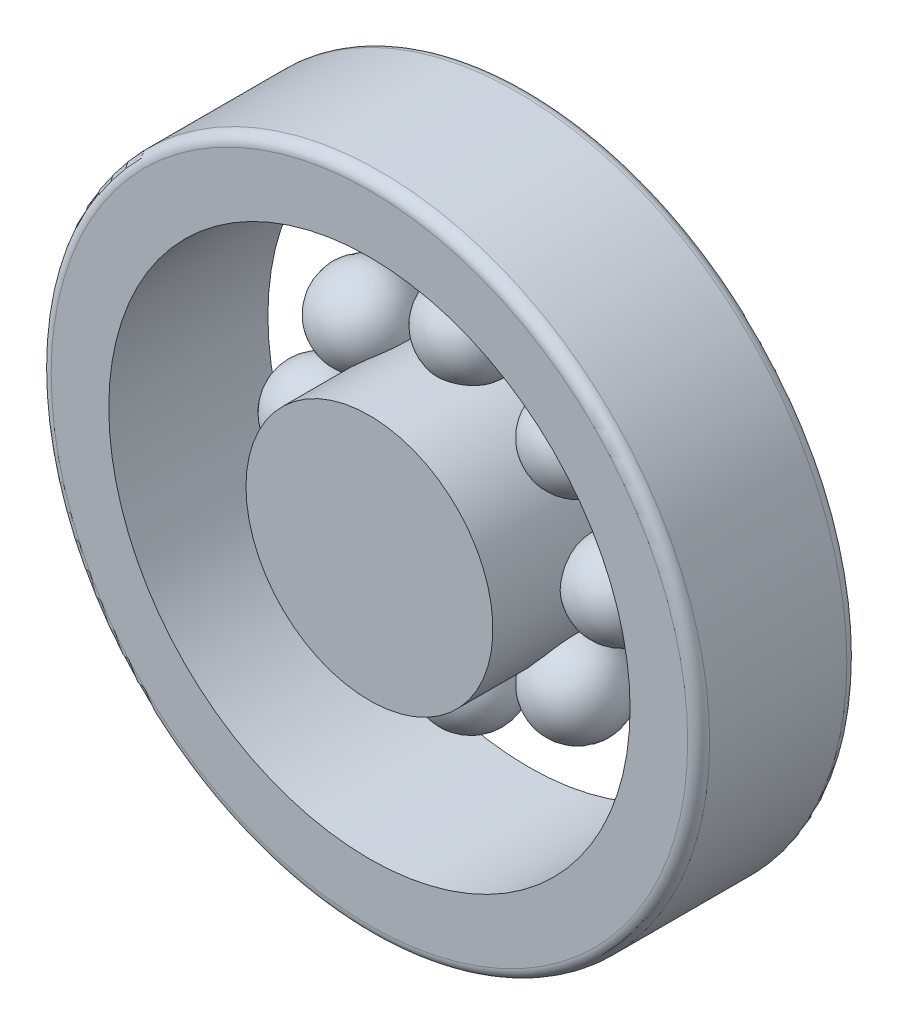
ISO-10303-21;
HEADER;
FILE_DESCRIPTION(('STEP AP214'),'2;1');
FILE_NAME('part.step','',(''),(''),'','','');
FILE_SCHEMA(('AUTOMOTIVE_DESIGN { 1 0 10303 214 1 1 1 1 }'));
ENDSEC;
DATA;
#1=APPLICATION_CONTEXT('core data for automotive mechanical design processes');
#2=APPLICATION_PROTOCOL_DEFINITION('international standard','automotive_design',2000,#1);
#3=PRODUCT_CONTEXT('',#1,'mechanical');
#4=PRODUCT('Part','Part','',(#3));
#5=PRODUCT_RELATED_PRODUCT_CATEGORY('part','',(#4));
#6=PRODUCT_DEFINITION_FORMATION('','',#4);
#7=PRODUCT_DEFINITION_CONTEXT('part definition',#1,'design');
#8=PRODUCT_DEFINITION('design','',#6,#7);
#9=PRODUCT_DEFINITION_SHAPE('','',#8);
#10=(LENGTH_UNIT() NAMED_UNIT(*) SI_UNIT(.MILLI.,.METRE.));
#11=(NAMED_UNIT(*) PLANE_ANGLE_UNIT() SI_UNIT($,.RADIAN.));
#12=(NAMED_UNIT(*) SI_UNIT($,.STERADIAN.) SOLID_ANGLE_UNIT());
#13=UNCERTAINTY_MEASURE_WITH_UNIT(LENGTH_MEASURE(1.E-05),#10,'distance_accuracy_value','');
#14=(GEOMETRIC_REPRESENTATION_CONTEXT(3) GLOBAL_UNCERTAINTY_ASSIGNED_CONTEXT((#13)) GLOBAL_UNIT_ASSIGNED_CONTEXT((#10,
#11,#12)) REPRESENTATION_CONTEXT('',''));
#15=CARTESIAN_POINT('',(0.,0.,0.));
#16=DIRECTION('',(0.,0.,1.));
#17=DIRECTION('',(1.,0.,0.));
#18=AXIS2_PLACEMENT_3D('',#15,#16,#17);
#19=CARTESIAN_POINT('',(19.4454364826303,-19.4454364826298,10.5));
#20=DIRECTION('',(0.,0.,-1.));
#21=DIRECTION('',(0.707106781186556,-0.707106781186539,0.));
#22=AXIS2_PLACEMENT_3D('',#19,#20,#21);
#23=SPHERICAL_SURFACE('',#22,8.);
#24=CARTESIAN_POINT('',(19.4454364826303,-19.4454364826298,2.50000000000001));
#25=VERTEX_POINT('',#24);
#26=VERTEX_LOOP('',#25);
#27=FACE_BOUND('',#26,.T.);
#28=ADVANCED_FACE('F50',(#27),#23,.T.);
#29=CLOSED_SHELL('',(#28));
#30=MANIFOLD_SOLID_BREP('B2',#29);
#31=CARTESIAN_POINT('',(2.88047210454559E-13,-27.5,10.5));
#32=DIRECTION('',(0.,0.,-1.));
#33=DIRECTION('',(0.,-1.,0.));
#34=AXIS2_PLACEMENT_3D('',#31,#32,#33);
#35=SPHERICAL_SURFACE('',#34,8.);
#36=CARTESIAN_POINT('',(2.88047210454559E-13,-27.5,2.50000000000001));
#37=VERTEX_POINT('',#36);
#38=VERTEX_LOOP('',#37);
#39=FACE_BOUND('',#38,.T.);
#40=ADVANCED_FACE('F71',(#39),#35,.T.);
#41=CLOSED_SHELL('',(#40));
#42=MANIFOLD_SOLID_BREP('B7',#41);
#43=CARTESIAN_POINT('',(-19.4454364826299,-19.4454364826302,10.5));
#44=DIRECTION('',(0.,0.,-1.));
#45=DIRECTION('',(-0.707106781186541,-0.707106781186554,0.));
#46=AXIS2_PLACEMENT_3D('',#43,#44,#45);
#47=SPHERICAL_SURFACE('',#46,8.);
#48=CARTESIAN_POINT('',(-19.4454364826299,-19.4454364826302,2.50000000000001));
#49=VERTEX_POINT('',#48);
#50=VERTEX_LOOP('',#49);
#51=FACE_BOUND('',#50,.T.);
#52=ADVANCED_FACE('F92',(#51),#47,.T.);
#53=CLOSED_SHELL('',(#52));
#54=MANIFOLD_SOLID_BREP('B46',#53);
#55=CARTESIAN_POINT('',(-27.5,0.,10.5));
#56=DIRECTION('',(0.,0.,-1.));
#57=DIRECTION('',(-1.,0.,0.));
#58=AXIS2_PLACEMENT_3D('',#55,#56,#57);
#59=SPHERICAL_SURFACE('',#58,8.);
#60=CARTESIAN_POINT('',(-27.5,0.,2.50000000000001));
#61=VERTEX_POINT('',#60);
#62=VERTEX_LOOP('',#61);
#63=FACE_BOUND('',#62,.T.);
#64=ADVANCED_FACE('F113',(#63),#59,.T.);
#65=CLOSED_SHELL('',(#64));
#66=MANIFOLD_SOLID_BREP('B67',#65);
#67=CARTESIAN_POINT('',(-19.4454364826302,19.44543648263,10.5));
#68=DIRECTION('',(0.,0.,-1.));
#69=DIRECTION('',(-0.707106781186551,0.707106781186544,0.));
#70=AXIS2_PLACEMENT_3D('',#67,#68,#69);
#71=SPHERICAL_SURFACE('',#70,8.);
#72=CARTESIAN_POINT('',(-19.4454364826302,19.44543648263,2.50000000000001));
#73=VERTEX_POINT('',#72);
#74=VERTEX_LOOP('',#73);
#75=FACE_BOUND('',#74,.T.);
#76=ADVANCED_FACE('F134',(#75),#71,.T.);
#77=CLOSED_SHELL('',(#76));
#78=MANIFOLD_SOLID_BREP('B88',#77);
#79=CARTESIAN_POINT('',(0.,27.5,10.5));
#80=DIRECTION('',(0.,0.,-1.));
#81=DIRECTION('',(0.,1.,0.));
#82=AXIS2_PLACEMENT_3D('',#79,#80,#81);
#83=SPHERICAL_SURFACE('',#82,8.);
#84=CARTESIAN_POINT('',(0.,27.5,2.50000000000001));
#85=VERTEX_POINT('',#84);
#86=VERTEX_LOOP('',#85);
#87=FACE_BOUND('',#86,.T.);
#88=ADVANCED_FACE('F155',(#87),#83,.T.);
#89=CLOSED_SHELL('',(#88));
#90=MANIFOLD_SOLID_BREP('B109',#89);
#91=CARTESIAN_POINT('',(19.44543648263,19.4454364826301,10.5));
#92=DIRECTION('',(0.,0.,-1.));
#93=DIRECTION('',(0.707106781186546,0.707106781186549,0.));
#94=AXIS2_PLACEMENT_3D('',#91,#92,#93);
#95=SPHERICAL_SURFACE('',#94,8.);
#96=CARTESIAN_POINT('',(19.44543648263,19.4454364826301,2.50000000000001));
#97=VERTEX_POINT('',#96);
#98=VERTEX_LOOP('',#97);
#99=FACE_BOUND('',#98,.T.);
#100=ADVANCED_FACE('F176',(#99),#95,.T.);
#101=CLOSED_SHELL('',(#100));
#102=MANIFOLD_SOLID_BREP('B130',#101);
#103=CARTESIAN_POINT('',(27.5,0.,10.5));
#104=DIRECTION('',(0.,0.,-1.));
#105=DIRECTION('',(1.,0.,0.));
#106=AXIS2_PLACEMENT_3D('',#103,#104,#105);
#107=SPHERICAL_SURFACE('',#106,8.);
#108=CARTESIAN_POINT('',(27.5,0.,2.50000000000001));
#109=VERTEX_POINT('',#108);
#110=VERTEX_LOOP('',#109);
#111=FACE_BOUND('',#110,.T.);
#112=ADVANCED_FACE('F199',(#111),#107,.T.);
#113=CLOSED_SHELL('',(#112));
#114=MANIFOLD_SOLID_BREP('B151',#113);
#115=CARTESIAN_POINT('',(0.,0.,29.));
#116=DIRECTION('',(0.,0.,-1.));
#117=DIRECTION('',(-1.,0.,0.));
#118=AXIS2_PLACEMENT_3D('',#115,#116,#117);
#119=CYLINDRICAL_SURFACE('',#118,22.5);
#120=CARTESIAN_POINT('',(0.,0.,29.));
#121=DIRECTION('',(0.,0.,1.));
#122=DIRECTION('',(1.,0.,0.));
#123=AXIS2_PLACEMENT_3D('',#120,#121,#122);
#124=CIRCLE('',#123,22.5);
#125=CARTESIAN_POINT('',(-22.5,0.,29.));
#126=VERTEX_POINT('',#125);
#127=EDGE_CURVE('E198',#126,#126,#124,.T.);
#128=CARTESIAN_POINT('',(0.,0.,0.));
#129=DIRECTION('',(0.,0.,1.));
#130=DIRECTION('',(1.,0.,0.));
#131=AXIS2_PLACEMENT_3D('',#128,#129,#130);
#132=CIRCLE('',#131,22.5);
#133=CARTESIAN_POINT('',(-22.5,0.,0.));
#134=VERTEX_POINT('',#133);
#135=EDGE_CURVE('E224',#134,#134,#132,.T.);
#136=CARTESIAN_POINT('',(-22.5,0.,29.));
#137=CARTESIAN_POINT('',(-22.5,0.,28.6979166666667));
#138=CARTESIAN_POINT('',(-22.5,0.,28.3958333333333));
#139=CARTESIAN_POINT('',(-22.5,0.,27.7916666666667));
#140=CARTESIAN_POINT('',(-22.5,0.,27.4895833333333));
#141=CARTESIAN_POINT('',(-22.5,0.,26.8854166666667));
#142=CARTESIAN_POINT('',(-22.5,0.,26.5833333333333));
#143=CARTESIAN_POINT('',(-22.5,0.,25.9791666666667));
#144=CARTESIAN_POINT('',(-22.5,0.,25.6770833333333));
#145=CARTESIAN_POINT('',(-22.5,0.,25.0729166666667));
#146=CARTESIAN_POINT('',(-22.5,0.,24.7708333333333));
#147=CARTESIAN_POINT('',(-22.5,0.,24.1666666666667));
#148=CARTESIAN_POINT('',(-22.5,0.,23.8645833333333));
#149=CARTESIAN_POINT('',(-22.5,0.,23.2604166666667));
#150=CARTESIAN_POINT('',(-22.5,0.,22.9583333333333));
#151=CARTESIAN_POINT('',(-22.5,0.,22.3541666666667));
#152=CARTESIAN_POINT('',(-22.5,0.,22.0520833333333));
#153=CARTESIAN_POINT('',(-22.5,0.,21.4479166666667));
#154=CARTESIAN_POINT('',(-22.5,0.,21.1458333333333));
#155=CARTESIAN_POINT('',(-22.5,0.,20.5416666666667));
#156=CARTESIAN_POINT('',(-22.5,0.,20.2395833333333));
#157=CARTESIAN_POINT('',(-22.5,0.,19.6354166666667));
#158=CARTESIAN_POINT('',(-22.5,0.,19.3333333333333));
#159=CARTESIAN_POINT('',(-22.5,0.,18.7291666666667));
#160=CARTESIAN_POINT('',(-22.5,0.,18.4270833333333));
#161=CARTESIAN_POINT('',(-22.5,0.,17.8229166666667));
#162=CARTESIAN_POINT('',(-22.5,0.,17.5208333333333));
#163=CARTESIAN_POINT('',(-22.5,0.,16.9166666666667));
#164=CARTESIAN_POINT('',(-22.5,0.,16.6145833333333));
#165=CARTESIAN_POINT('',(-22.5,0.,16.0104166666667));
#166=CARTESIAN_POINT('',(-22.5,0.,15.7083333333333));
#167=CARTESIAN_POINT('',(-22.5,0.,15.1041666666667));
#168=CARTESIAN_POINT('',(-22.5,0.,14.8020833333333));
#169=CARTESIAN_POINT('',(-22.5,0.,14.1979166666667));
#170=CARTESIAN_POINT('',(-22.5,0.,13.8958333333333));
#171=CARTESIAN_POINT('',(-22.5,0.,13.2916666666667));
#172=CARTESIAN_POINT('',(-22.5,0.,12.9895833333333));
#173=CARTESIAN_POINT('',(-22.5,0.,12.3854166666667));
#174=CARTESIAN_POINT('',(-22.5,0.,12.0833333333333));
#175=CARTESIAN_POINT('',(-22.5,0.,11.4791666666667));
#176=CARTESIAN_POINT('',(-22.5,0.,11.1770833333333));
#177=CARTESIAN_POINT('',(-22.5,0.,10.5729166666667));
#178=CARTESIAN_POINT('',(-22.5,0.,10.2708333333333));
#179=CARTESIAN_POINT('',(-22.5,0.,9.66666666666667));
#180=CARTESIAN_POINT('',(-22.5,0.,9.36458333333333));
#181=CARTESIAN_POINT('',(-22.5,0.,8.76041666666667));
#182=CARTESIAN_POINT('',(-22.5,0.,8.45833333333333));
#183=CARTESIAN_POINT('',(-22.5,0.,7.85416666666667));
#184=CARTESIAN_POINT('',(-22.5,0.,7.55208333333333));
#185=CARTESIAN_POINT('',(-22.5,0.,6.94791666666667));
#186=CARTESIAN_POINT('',(-22.5,0.,6.64583333333333));
#187=CARTESIAN_POINT('',(-22.5,0.,6.04166666666667));
#188=CARTESIAN_POINT('',(-22.5,0.,5.73958333333333));
#189=CARTESIAN_POINT('',(-22.5,0.,5.13541666666667));
#190=CARTESIAN_POINT('',(-22.5,0.,4.83333333333333));
#191=CARTESIAN_POINT('',(-22.5,0.,4.22916666666667));
#192=CARTESIAN_POINT('',(-22.5,0.,3.92708333333333));
#193=CARTESIAN_POINT('',(-22.5,0.,3.32291666666667));
#194=CARTESIAN_POINT('',(-22.5,0.,3.02083333333333));
#195=CARTESIAN_POINT('',(-22.5,0.,2.41666666666667));
#196=CARTESIAN_POINT('',(-22.5,0.,2.11458333333333));
#197=CARTESIAN_POINT('',(-22.5,0.,1.51041666666667));
#198=CARTESIAN_POINT('',(-22.5,0.,1.20833333333333));
#199=CARTESIAN_POINT('',(-22.5,0.,0.604166666666667));
#200=CARTESIAN_POINT('',(-22.5,0.,0.302083333333333));
#201=CARTESIAN_POINT('',(-22.5,0.,0.));
#202=B_SPLINE_CURVE_WITH_KNOTS('',3,(#136,#137,#138,#139,#140,#141,#142,#143,#144,#145,#146,
#147,#148,#149,#150,#151,#152,#153,#154,#155,#156,#157,#158,#159,#160,#161,#162,#163,#164,#165,
#166,#167,#168,#169,#170,#171,#172,#173,#174,#175,#176,#177,#178,#179,#180,#181,#182,#183,#184,
#185,#186,#187,#188,#189,#190,#191,#192,#193,#194,#195,#196,#197,#198,#199,#200,#201),
.UNSPECIFIED.,.F.,.F.,(4,2,2,2,2,2,2,2,2,2,2,2,2,2,2,2,2,2,2,2,2,2,2,2,2,2,2,2,2,2,2,2,4),(0.,
0.906249999999997,1.8125,2.71875,3.625,4.53125,5.4375,6.34375,7.25,8.15625,9.0625,9.96875,
10.875,11.78125,12.6875,13.59375,14.5,15.40625,16.3125,17.21875,18.125,19.03125,19.9375,
20.84375,21.75,22.65625,23.5625,24.46875,25.375,26.28125,27.1875,28.09375,29.),.UNSPECIFIED.);
#203=EDGE_CURVE('BSEAM221',#126,#134,#202,.T.);
#204=ORIENTED_EDGE('',*,*,#127,.F.);
#205=ORIENTED_EDGE('',*,*,#135,.T.);
#206=ORIENTED_EDGE('',*,*,#203,.T.);
#207=ORIENTED_EDGE('',*,*,#203,.F.);
#208=EDGE_LOOP('',(#204,#206,#205,#207));
#209=FACE_BOUND('',#208,.T.);
#210=ADVANCED_FACE('F221',(#209),#119,.T.);
#211=CARTESIAN_POINT('',(0.,0.,29.));
#212=DIRECTION('',(0.,0.,1.));
#213=DIRECTION('',(1.,0.,0.));
#214=AXIS2_PLACEMENT_3D('',#211,#212,#213);
#215=PLANE('',#214);
#216=ORIENTED_EDGE('',*,*,#127,.T.);
#217=EDGE_LOOP('',(#216));
#218=FACE_BOUND('',#217,.T.);
#219=ADVANCED_FACE('F236',(#218),#215,.T.);
#220=CARTESIAN_POINT('',(0.,0.,0.));
#221=DIRECTION('',(0.,0.,1.));
#222=DIRECTION('',(1.,0.,0.));
#223=AXIS2_PLACEMENT_3D('',#220,#221,#222);
#224=PLANE('',#223);
#225=ORIENTED_EDGE('',*,*,#135,.F.);
#226=EDGE_LOOP('',(#225));
#227=FACE_BOUND('',#226,.T.);
#228=ADVANCED_FACE('F234',(#227),#224,.F.);
#229=CLOSED_SHELL('',(#210,#219,#228));
#230=MANIFOLD_SOLID_BREP('B172',#229);
#231=CARTESIAN_POINT('',(0.,0.,29.));
#232=DIRECTION('',(0.,0.,-1.));
#233=DIRECTION('',(-1.,0.,0.));
#234=AXIS2_PLACEMENT_3D('',#231,#232,#233);
#235=CYLINDRICAL_SURFACE('',#234,47.5);
#236=CARTESIAN_POINT('',(0.,0.,29.));
#237=DIRECTION('',(0.,0.,1.));
#238=DIRECTION('',(1.,0.,0.));
#239=AXIS2_PLACEMENT_3D('',#236,#237,#238);
#240=CIRCLE('',#239,47.5);
#241=CARTESIAN_POINT('',(-47.5,0.,29.));
#242=VERTEX_POINT('',#241);
#243=EDGE_CURVE('E288',#242,#242,#240,.T.);
#244=CARTESIAN_POINT('',(0.,0.,0.));
#245=DIRECTION('',(0.,0.,1.));
#246=DIRECTION('',(1.,0.,0.));
#247=AXIS2_PLACEMENT_3D('',#244,#245,#246);
#248=CIRCLE('',#247,47.5);
#249=CARTESIAN_POINT('',(-47.5,0.,0.));
#250=VERTEX_POINT('',#249);
#251=EDGE_CURVE('E289',#250,#250,#248,.T.);
#252=CARTESIAN_POINT('',(-47.5,0.,29.));
#253=CARTESIAN_POINT('',(-47.5,0.,28.6979166666667));
#254=CARTESIAN_POINT('',(-47.5,0.,28.3958333333333));
#255=CARTESIAN_POINT('',(-47.5,0.,27.7916666666667));
#256=CARTESIAN_POINT('',(-47.5,0.,27.4895833333333));
#257=CARTESIAN_POINT('',(-47.5,0.,26.8854166666667));
#258=CARTESIAN_POINT('',(-47.5,0.,26.5833333333333));
#259=CARTESIAN_POINT('',(-47.5,0.,25.9791666666667));
#260=CARTESIAN_POINT('',(-47.5,0.,25.6770833333333));
#261=CARTESIAN_POINT('',(-47.5,0.,25.0729166666667));
#262=CARTESIAN_POINT('',(-47.5,0.,24.7708333333333));
#263=CARTESIAN_POINT('',(-47.5,0.,24.1666666666667));
#264=CARTESIAN_POINT('',(-47.5,0.,23.8645833333333));
#265=CARTESIAN_POINT('',(-47.5,0.,23.2604166666667));
#266=CARTESIAN_POINT('',(-47.5,0.,22.9583333333333));
#267=CARTESIAN_POINT('',(-47.5,0.,22.3541666666667));
#268=CARTESIAN_POINT('',(-47.5,0.,22.0520833333333));
#269=CARTESIAN_POINT('',(-47.5,0.,21.4479166666667));
#270=CARTESIAN_POINT('',(-47.5,0.,21.1458333333333));
#271=CARTESIAN_POINT('',(-47.5,0.,20.5416666666667));
#272=CARTESIAN_POINT('',(-47.5,0.,20.2395833333333));
#273=CARTESIAN_POINT('',(-47.5,0.,19.6354166666667));
#274=CARTESIAN_POINT('',(-47.5,0.,19.3333333333333));
#275=CARTESIAN_POINT('',(-47.5,0.,18.7291666666667));
#276=CARTESIAN_POINT('',(-47.5,0.,18.4270833333333));
#277=CARTESIAN_POINT('',(-47.5,0.,17.8229166666667));
#278=CARTESIAN_POINT('',(-47.5,0.,17.5208333333333));
#279=CARTESIAN_POINT('',(-47.5,0.,16.9166666666667));
#280=CARTESIAN_POINT('',(-47.5,0.,16.6145833333333));
#281=CARTESIAN_POINT('',(-47.5,0.,16.0104166666667));
#282=CARTESIAN_POINT('',(-47.5,0.,15.7083333333333));
#283=CARTESIAN_POINT('',(-47.5,0.,15.1041666666667));
#284=CARTESIAN_POINT('',(-47.5,0.,14.8020833333333));
#285=CARTESIAN_POINT('',(-47.5,0.,14.1979166666667));
#286=CARTESIAN_POINT('',(-47.5,0.,13.8958333333333));
#287=CARTESIAN_POINT('',(-47.5,0.,13.2916666666667));
#288=CARTESIAN_POINT('',(-47.5,0.,12.9895833333333));
#289=CARTESIAN_POINT('',(-47.5,0.,12.3854166666667));
#290=CARTESIAN_POINT('',(-47.5,0.,12.0833333333333));
#291=CARTESIAN_POINT('',(-47.5,0.,11.4791666666667));
#292=CARTESIAN_POINT('',(-47.5,0.,11.1770833333333));
#293=CARTESIAN_POINT('',(-47.5,0.,10.5729166666667));
#294=CARTESIAN_POINT('',(-47.5,0.,10.2708333333333));
#295=CARTESIAN_POINT('',(-47.5,0.,9.66666666666667));
#296=CARTESIAN_POINT('',(-47.5,0.,9.36458333333333));
#297=CARTESIAN_POINT('',(-47.5,0.,8.76041666666667));
#298=CARTESIAN_POINT('',(-47.5,0.,8.45833333333333));
#299=CARTESIAN_POINT('',(-47.5,0.,7.85416666666667));
#300=CARTESIAN_POINT('',(-47.5,0.,7.55208333333333));
#301=CARTESIAN_POINT('',(-47.5,0.,6.94791666666667));
#302=CARTESIAN_POINT('',(-47.5,0.,6.64583333333333));
#303=CARTESIAN_POINT('',(-47.5,0.,6.04166666666667));
#304=CARTESIAN_POINT('',(-47.5,0.,5.73958333333333));
#305=CARTESIAN_POINT('',(-47.5,0.,5.13541666666667));
#306=CARTESIAN_POINT('',(-47.5,0.,4.83333333333333));
#307=CARTESIAN_POINT('',(-47.5,0.,4.22916666666667));
#308=CARTESIAN_POINT('',(-47.5,0.,3.92708333333333));
#309=CARTESIAN_POINT('',(-47.5,0.,3.32291666666667));
#310=CARTESIAN_POINT('',(-47.5,0.,3.02083333333333));
#311=CARTESIAN_POINT('',(-47.5,0.,2.41666666666667));
#312=CARTESIAN_POINT('',(-47.5,0.,2.11458333333333));
#313=CARTESIAN_POINT('',(-47.5,0.,1.51041666666667));
#314=CARTESIAN_POINT('',(-47.5,0.,1.20833333333333));
#315=CARTESIAN_POINT('',(-47.5,0.,0.604166666666667));
#316=CARTESIAN_POINT('',(-47.5,0.,0.302083333333333));
#317=CARTESIAN_POINT('',(-47.5,0.,0.));
#318=B_SPLINE_CURVE_WITH_KNOTS('',3,(#252,#253,#254,#255,#256,#257,#258,#259,#260,#261,#262,
#263,#264,#265,#266,#267,#268,#269,#270,#271,#272,#273,#274,#275,#276,#277,#278,#279,#280,#281,
#282,#283,#284,#285,#286,#287,#288,#289,#290,#291,#292,#293,#294,#295,#296,#297,#298,#299,#300,
#301,#302,#303,#304,#305,#306,#307,#308,#309,#310,#311,#312,#313,#314,#315,#316,#317),
.UNSPECIFIED.,.F.,.F.,(4,2,2,2,2,2,2,2,2,2,2,2,2,2,2,2,2,2,2,2,2,2,2,2,2,2,2,2,2,2,2,2,4),(0.,
0.906249999999997,1.8125,2.71875,3.625,4.53125,5.4375,6.34375,7.25,8.15625,9.0625,9.96875,
10.875,11.78125,12.6875,13.59375,14.5,15.40625,16.3125,17.21875,18.125,19.03125,19.9375,
20.84375,21.75,22.65625,23.5625,24.46875,25.375,26.28125,27.1875,28.09375,29.),.UNSPECIFIED.);
#319=EDGE_CURVE('BSEAM268',#242,#250,#318,.T.);
#320=ORIENTED_EDGE('',*,*,#243,.T.);
#321=ORIENTED_EDGE('',*,*,#251,.F.);
#322=ORIENTED_EDGE('',*,*,#319,.T.);
#323=ORIENTED_EDGE('',*,*,#319,.F.);
#324=EDGE_LOOP('',(#320,#322,#321,#323));
#325=FACE_BOUND('',#324,.T.);
#326=ADVANCED_FACE('F268',(#325),#235,.F.);
#327=CARTESIAN_POINT('',(0.,0.,29.));
#328=DIRECTION('',(0.,0.,-1.));
#329=DIRECTION('',(-1.,0.,0.));
#330=AXIS2_PLACEMENT_3D('',#327,#328,#329);
#331=CYLINDRICAL_SURFACE('',#330,60.);
#332=CARTESIAN_POINT('',(0.,0.,27.));
#333=DIRECTION('',(0.,0.,1.));
#334=DIRECTION('',(1.,0.,0.));
#335=AXIS2_PLACEMENT_3D('',#332,#333,#334);
#336=CIRCLE('',#335,60.);
#337=CARTESIAN_POINT('',(-60.,0.,27.));
#338=VERTEX_POINT('',#337);
#339=EDGE_CURVE('E275',#338,#338,#336,.F.);
#340=CARTESIAN_POINT('',(0.,0.,2.));
#341=DIRECTION('',(0.,0.,1.));
#342=DIRECTION('',(1.,0.,0.));
#343=AXIS2_PLACEMENT_3D('',#340,#341,#342);
#344=CIRCLE('',#343,60.);
#345=CARTESIAN_POINT('',(-60.,0.,1.99999999999999));
#346=VERTEX_POINT('',#345);
#347=EDGE_CURVE('E279',#346,#346,#344,.T.);
#348=CARTESIAN_POINT('',(-60.,0.,27.));
#349=CARTESIAN_POINT('',(-60.,0.,26.7395833333333));
#350=CARTESIAN_POINT('',(-60.,0.,26.4791666666667));
#351=CARTESIAN_POINT('',(-60.,0.,25.9583333333333));
#352=CARTESIAN_POINT('',(-60.,0.,25.6979166666667));
#353=CARTESIAN_POINT('',(-60.,0.,25.1770833333333));
#354=CARTESIAN_POINT('',(-60.,0.,24.9166666666667));
#355=CARTESIAN_POINT('',(-60.,0.,24.3958333333333));
#356=CARTESIAN_POINT('',(-60.,0.,24.1354166666667));
#357=CARTESIAN_POINT('',(-60.,0.,23.6145833333333));
#358=CARTESIAN_POINT('',(-60.,0.,23.3541666666667));
#359=CARTESIAN_POINT('',(-60.,0.,22.8333333333333));
#360=CARTESIAN_POINT('',(-60.,0.,22.5729166666667));
#361=CARTESIAN_POINT('',(-60.,0.,22.0520833333333));
#362=CARTESIAN_POINT('',(-60.,0.,21.7916666666667));
#363=CARTESIAN_POINT('',(-60.,0.,21.2708333333333));
#364=CARTESIAN_POINT('',(-60.,0.,21.0104166666667));
#365=CARTESIAN_POINT('',(-60.,0.,20.4895833333333));
#366=CARTESIAN_POINT('',(-60.,0.,20.2291666666667));
#367=CARTESIAN_POINT('',(-60.,0.,19.7083333333333));
#368=CARTESIAN_POINT('',(-60.,0.,19.4479166666667));
#369=CARTESIAN_POINT('',(-60.,0.,18.9270833333333));
#370=CARTESIAN_POINT('',(-60.,0.,18.6666666666667));
#371=CARTESIAN_POINT('',(-60.,0.,18.1458333333333));
#372=CARTESIAN_POINT('',(-60.,0.,17.8854166666667));
#373=CARTESIAN_POINT('',(-60.,0.,17.3645833333333));
#374=CARTESIAN_POINT('',(-60.,0.,17.1041666666667));
#375=CARTESIAN_POINT('',(-60.,0.,16.5833333333333));
#376=CARTESIAN_POINT('',(-60.,0.,16.3229166666667));
#377=CARTESIAN_POINT('',(-60.,0.,15.8020833333333));
#378=CARTESIAN_POINT('',(-60.,0.,15.5416666666667));
#379=CARTESIAN_POINT('',(-60.,0.,15.0208333333333));
#380=CARTESIAN_POINT('',(-60.,0.,14.7604166666667));
#381=CARTESIAN_POINT('',(-60.,0.,14.2395833333333));
#382=CARTESIAN_POINT('',(-60.,0.,13.9791666666667));
#383=CARTESIAN_POINT('',(-60.,0.,13.4583333333333));
#384=CARTESIAN_POINT('',(-60.,0.,13.1979166666667));
#385=CARTESIAN_POINT('',(-60.,0.,12.6770833333333));
#386=CARTESIAN_POINT('',(-60.,0.,12.4166666666667));
#387=CARTESIAN_POINT('',(-60.,0.,11.8958333333333));
#388=CARTESIAN_POINT('',(-60.,0.,11.6354166666667));
#389=CARTESIAN_POINT('',(-60.,0.,11.1145833333333));
#390=CARTESIAN_POINT('',(-60.,0.,10.8541666666667));
#391=CARTESIAN_POINT('',(-60.,0.,10.3333333333333));
#392=CARTESIAN_POINT('',(-60.,0.,10.0729166666667));
#393=CARTESIAN_POINT('',(-60.,0.,9.55208333333333));
#394=CARTESIAN_POINT('',(-60.,0.,9.29166666666666));
#395=CARTESIAN_POINT('',(-60.,0.,8.77083333333333));
#396=CARTESIAN_POINT('',(-60.,0.,8.51041666666666));
#397=CARTESIAN_POINT('',(-60.,0.,7.98958333333333));
#398=CARTESIAN_POINT('',(-60.,0.,7.72916666666666));
#399=CARTESIAN_POINT('',(-60.,0.,7.20833333333333));
#400=CARTESIAN_POINT('',(-60.,0.,6.94791666666666));
#401=CARTESIAN_POINT('',(-60.,0.,6.42708333333333));
#402=CARTESIAN_POINT('',(-60.,0.,6.16666666666666));
#403=CARTESIAN_POINT('',(-60.,0.,5.64583333333333));
#404=CARTESIAN_POINT('',(-60.,0.,5.38541666666666));
#405=CARTESIAN_POINT('',(-60.,0.,4.86458333333333));
#406=CARTESIAN_POINT('',(-60.,0.,4.60416666666666));
#407=CARTESIAN_POINT('',(-60.,0.,4.08333333333333));
#408=CARTESIAN_POINT('',(-60.,0.,3.82291666666666));
#409=CARTESIAN_POINT('',(-60.,0.,3.30208333333333));
#410=CARTESIAN_POINT('',(-60.,0.,3.04166666666666));
#411=CARTESIAN_POINT('',(-60.,0.,2.52083333333333));
#412=CARTESIAN_POINT('',(-60.,0.,2.26041666666666));
#413=CARTESIAN_POINT('',(-60.,0.,1.99999999999999));
#414=B_SPLINE_CURVE_WITH_KNOTS('',3,(#348,#349,#350,#351,#352,#353,#354,#355,#356,#357,#358,
#359,#360,#361,#362,#363,#364,#365,#366,#367,#368,#369,#370,#371,#372,#373,#374,#375,#376,#377,
#378,#379,#380,#381,#382,#383,#384,#385,#386,#387,#388,#389,#390,#391,#392,#393,#394,#395,#396,
#397,#398,#399,#400,#401,#402,#403,#404,#405,#406,#407,#408,#409,#410,#411,#412,#413),
.UNSPECIFIED.,.F.,.F.,(4,2,2,2,2,2,2,2,2,2,2,2,2,2,2,2,2,2,2,2,2,2,2,2,2,2,2,2,2,2,2,2,4),(0.,
0.781250000000001,1.5625,2.34375,3.125,3.90625,4.6875,5.46875,6.25,7.03125,7.8125,8.59375,9.375,
10.15625,10.9375,11.71875,12.5,13.28125,14.0625,14.84375,15.625,16.40625,17.1875,17.96875,18.75,
19.53125,20.3125,21.09375,21.875,22.65625,23.4375,24.21875,25.),.UNSPECIFIED.);
#415=EDGE_CURVE('BSEAM300',#338,#346,#414,.T.);
#416=ORIENTED_EDGE('',*,*,#339,.T.);
#417=ORIENTED_EDGE('',*,*,#347,.T.);
#418=ORIENTED_EDGE('',*,*,#415,.T.);
#419=ORIENTED_EDGE('',*,*,#415,.F.);
#420=EDGE_LOOP('',(#416,#418,#417,#419));
#421=FACE_BOUND('',#420,.T.);
#422=ADVANCED_FACE('F300',(#421),#331,.T.);
#423=CARTESIAN_POINT('',(0.,0.,29.));
#424=DIRECTION('',(0.,0.,1.));
#425=DIRECTION('',(1.,0.,0.));
#426=AXIS2_PLACEMENT_3D('',#423,#424,#425);
#427=PLANE('',#426);
#428=CARTESIAN_POINT('',(0.,0.,29.));
#429=DIRECTION('',(0.,0.,1.));
#430=DIRECTION('',(1.,0.,0.));
#431=AXIS2_PLACEMENT_3D('',#428,#429,#430);
#432=CIRCLE('',#431,58.);
#433=CARTESIAN_POINT('',(58.,0.,29.));
#434=VERTEX_POINT('',#433);
#435=EDGE_CURVE('E283',#434,#434,#432,.T.);
#436=ORIENTED_EDGE('',*,*,#435,.T.);
#437=EDGE_LOOP('',(#436));
#438=FACE_BOUND('',#437,.T.);
#439=ORIENTED_EDGE('',*,*,#243,.F.);
#440=EDGE_LOOP('',(#439));
#441=FACE_BOUND('',#440,.T.);
#442=ADVANCED_FACE('F297',(#438,#441),#427,.T.);
#443=CARTESIAN_POINT('',(0.,0.,0.));
#444=DIRECTION('',(0.,0.,1.));
#445=DIRECTION('',(1.,0.,0.));
#446=AXIS2_PLACEMENT_3D('',#443,#444,#445);
#447=PLANE('',#446);
#448=CARTESIAN_POINT('',(0.,0.,0.));
#449=DIRECTION('',(0.,0.,1.));
#450=DIRECTION('',(1.,0.,0.));
#451=AXIS2_PLACEMENT_3D('',#448,#449,#450);
#452=CIRCLE('',#451,58.);
#453=CARTESIAN_POINT('',(58.,0.,0.));
#454=VERTEX_POINT('',#453);
#455=EDGE_CURVE('E220',#454,#454,#452,.F.);
#456=ORIENTED_EDGE('',*,*,#455,.T.);
#457=EDGE_LOOP('',(#456));
#458=FACE_BOUND('',#457,.T.);
#459=ORIENTED_EDGE('',*,*,#251,.T.);
#460=EDGE_LOOP('',(#459));
#461=FACE_BOUND('',#460,.T.);
#462=ADVANCED_FACE('F299',(#458,#461),#447,.F.);
#463=CARTESIAN_POINT('',(0.,0.,27.));
#464=DIRECTION('',(0.,0.,1.));
#465=DIRECTION('',(1.,0.,0.));
#466=AXIS2_PLACEMENT_3D('',#463,#464,#465);
#467=TOROIDAL_SURFACE('',#466,58.,2.);
#468=ORIENTED_EDGE('',*,*,#339,.F.);
#469=EDGE_LOOP('',(#468));
#470=FACE_BOUND('',#469,.T.);
#471=ORIENTED_EDGE('',*,*,#435,.F.);
#472=EDGE_LOOP('',(#471));
#473=FACE_BOUND('',#472,.T.);
#474=ADVANCED_FACE('F307',(#470,#473),#467,.T.);
#475=CARTESIAN_POINT('',(0.,0.,2.));
#476=DIRECTION('',(0.,0.,1.));
#477=DIRECTION('',(1.,0.,0.));
#478=AXIS2_PLACEMENT_3D('',#475,#476,#477);
#479=TOROIDAL_SURFACE('',#478,58.,2.);
#480=ORIENTED_EDGE('',*,*,#455,.F.);
#481=EDGE_LOOP('',(#480));
#482=FACE_BOUND('',#481,.T.);
#483=ORIENTED_EDGE('',*,*,#347,.F.);
#484=EDGE_LOOP('',(#483));
#485=FACE_BOUND('',#484,.T.);
#486=ADVANCED_FACE('F270',(#482,#485),#479,.T.);
#487=CLOSED_SHELL('',(#326,#422,#442,#462,#474,#486));
#488=MANIFOLD_SOLID_BREP('B193',#487);
#489=ADVANCED_BREP_SHAPE_REPRESENTATION('',(#18,#30,#42,#54,#66,#78,#90,#102,#114,#230,#488),#14);
#490=SHAPE_DEFINITION_REPRESENTATION(#9,#489);
ENDSEC;
END-ISO-10303-21;
